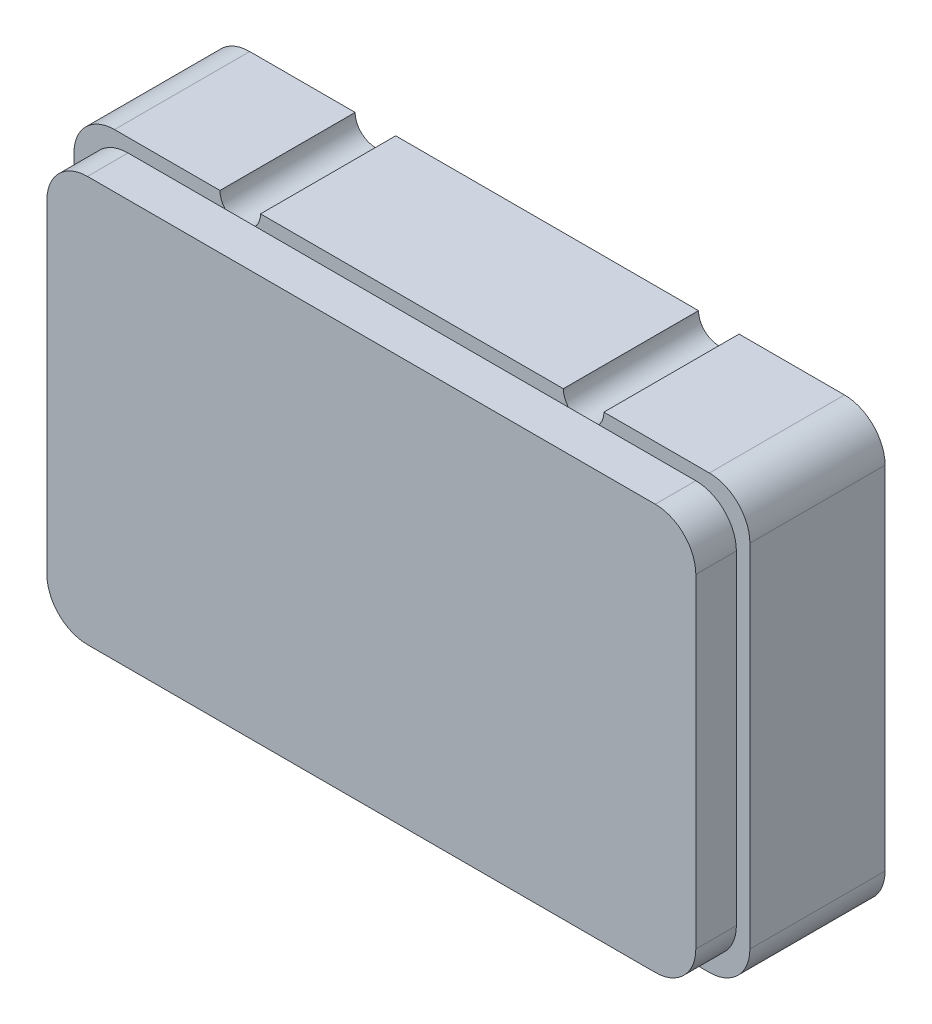
ISO-10303-21;
HEADER;
FILE_DESCRIPTION(('STEP AP214'),'2;1');
FILE_NAME('part.step','',(''),(''),'','','');
FILE_SCHEMA(('AUTOMOTIVE_DESIGN { 1 0 10303 214 1 1 1 1 }'));
ENDSEC;
DATA;
#1=APPLICATION_CONTEXT('core data for automotive mechanical design processes');
#2=APPLICATION_PROTOCOL_DEFINITION('international standard','automotive_design',2000,#1);
#3=PRODUCT_CONTEXT('',#1,'mechanical');
#4=PRODUCT('Part','Part','',(#3));
#5=PRODUCT_RELATED_PRODUCT_CATEGORY('part','',(#4));
#6=PRODUCT_DEFINITION_FORMATION('','',#4);
#7=PRODUCT_DEFINITION_CONTEXT('part definition',#1,'design');
#8=PRODUCT_DEFINITION('design','',#6,#7);
#9=PRODUCT_DEFINITION_SHAPE('','',#8);
#10=(LENGTH_UNIT() NAMED_UNIT(*) SI_UNIT(.MILLI.,.METRE.));
#11=(NAMED_UNIT(*) PLANE_ANGLE_UNIT() SI_UNIT($,.RADIAN.));
#12=(NAMED_UNIT(*) SI_UNIT($,.STERADIAN.) SOLID_ANGLE_UNIT());
#13=UNCERTAINTY_MEASURE_WITH_UNIT(LENGTH_MEASURE(1.E-05),#10,'distance_accuracy_value','');
#14=(GEOMETRIC_REPRESENTATION_CONTEXT(3) GLOBAL_UNCERTAINTY_ASSIGNED_CONTEXT((#13)) GLOBAL_UNIT_ASSIGNED_CONTEXT((#10,
#11,#12)) REPRESENTATION_CONTEXT('',''));
#15=CARTESIAN_POINT('',(0.,0.,0.));
#16=DIRECTION('',(0.,0.,1.));
#17=DIRECTION('',(1.,0.,0.));
#18=AXIS2_PLACEMENT_3D('',#15,#16,#17);
#19=CARTESIAN_POINT('',(0.,0.,1.));
#20=DIRECTION('',(0.,0.,-1.));
#21=DIRECTION('',(-1.,0.,0.));
#22=AXIS2_PLACEMENT_3D('',#19,#20,#21);
#23=PLANE('',#22);
#24=CARTESIAN_POINT('',(1.23,0.,1.));
#25=DIRECTION('',(0.,0.,-1.));
#26=DIRECTION('',(-1.,0.,0.));
#27=AXIS2_PLACEMENT_3D('',#24,#25,#26);
#28=CIRCLE('',#27,0.15);
#29=CARTESIAN_POINT('',(1.34180339887499,0.1,1.));
#30=VERTEX_POINT('',#29);
#31=CARTESIAN_POINT('',(1.38,0.,1.));
#32=VERTEX_POINT('',#31);
#33=EDGE_CURVE('E444',#30,#32,#28,.T.);
#34=ORIENTED_EDGE('',*,*,#33,.T.);
#35=DIRECTION('',(1.,0.,0.));
#36=VECTOR('',#35,1.);
#37=CARTESIAN_POINT('',(0.,0.,1.));
#38=LINE('',#37,#36);
#39=CARTESIAN_POINT('',(3.62,0.,1.));
#40=VERTEX_POINT('',#39);
#41=EDGE_CURVE('E236',#32,#40,#38,.T.);
#42=ORIENTED_EDGE('',*,*,#41,.T.);
#43=CARTESIAN_POINT('',(3.77,0.,1.));
#44=DIRECTION('',(0.,0.,-1.));
#45=DIRECTION('',(-1.,0.,0.));
#46=AXIS2_PLACEMENT_3D('',#43,#44,#45);
#47=CIRCLE('',#46,0.15);
#48=CARTESIAN_POINT('',(3.65819660112501,0.1,1.));
#49=VERTEX_POINT('',#48);
#50=EDGE_CURVE('E509',#40,#49,#47,.T.);
#51=ORIENTED_EDGE('',*,*,#50,.T.);
#52=DIRECTION('',(1.,0.,0.));
#53=VECTOR('',#52,1.);
#54=CARTESIAN_POINT('',(0.1,0.1,1.));
#55=LINE('',#54,#53);
#56=EDGE_CURVE('E398',#30,#49,#55,.T.);
#57=ORIENTED_EDGE('',*,*,#56,.F.);
#58=EDGE_LOOP('',(#34,#42,#51,#57));
#59=FACE_BOUND('',#58,.T.);
#60=ADVANCED_FACE('F33',(#59),#23,.F.);
#61=CARTESIAN_POINT('',(1.08,0.,1.));
#62=VERTEX_POINT('',#61);
#63=CARTESIAN_POINT('',(1.11819660112501,0.1,1.));
#64=VERTEX_POINT('',#63);
#65=EDGE_CURVE('E442',#62,#64,#28,.T.);
#66=ORIENTED_EDGE('',*,*,#65,.T.);
#67=CARTESIAN_POINT('',(0.4,0.1,1.));
#68=VERTEX_POINT('',#67);
#69=EDGE_CURVE('E393',#68,#64,#55,.T.);
#70=ORIENTED_EDGE('',*,*,#69,.F.);
#71=CARTESIAN_POINT('',(0.4,0.4,1.));
#72=DIRECTION('',(0.,0.,-1.));
#73=DIRECTION('',(-1.,0.,0.));
#74=AXIS2_PLACEMENT_3D('',#71,#72,#73);
#75=CIRCLE('',#74,0.3);
#76=CARTESIAN_POINT('',(0.1,0.4,1.));
#77=VERTEX_POINT('',#76);
#78=EDGE_CURVE('E292',#68,#77,#75,.T.);
#79=ORIENTED_EDGE('',*,*,#78,.T.);
#80=DIRECTION('',(0.,-1.,0.));
#81=VECTOR('',#80,1.);
#82=CARTESIAN_POINT('',(0.1,0.1,1.));
#83=LINE('',#82,#81);
#84=CARTESIAN_POINT('',(0.1,2.8,1.));
#85=VERTEX_POINT('',#84);
#86=EDGE_CURVE('E389',#85,#77,#83,.T.);
#87=ORIENTED_EDGE('',*,*,#86,.F.);
#88=CARTESIAN_POINT('',(0.4,2.8,1.));
#89=DIRECTION('',(0.,0.,-1.));
#90=DIRECTION('',(-1.,0.,0.));
#91=AXIS2_PLACEMENT_3D('',#88,#89,#90);
#92=CIRCLE('',#91,0.3);
#93=CARTESIAN_POINT('',(0.4,3.1,1.));
#94=VERTEX_POINT('',#93);
#95=EDGE_CURVE('E289',#85,#94,#92,.T.);
#96=ORIENTED_EDGE('',*,*,#95,.T.);
#97=DIRECTION('',(-1.,0.,0.));
#98=VECTOR('',#97,1.);
#99=CARTESIAN_POINT('',(0.1,3.1,1.));
#100=LINE('',#99,#98);
#101=CARTESIAN_POINT('',(1.11819660112501,3.1,1.));
#102=VERTEX_POINT('',#101);
#103=EDGE_CURVE('E402',#102,#94,#100,.T.);
#104=ORIENTED_EDGE('',*,*,#103,.F.);
#105=CARTESIAN_POINT('',(1.23,3.2,1.));
#106=DIRECTION('',(0.,0.,-1.));
#107=DIRECTION('',(-1.,0.,0.));
#108=AXIS2_PLACEMENT_3D('',#105,#106,#107);
#109=CIRCLE('',#108,0.15);
#110=CARTESIAN_POINT('',(1.08,3.2,1.));
#111=VERTEX_POINT('',#110);
#112=EDGE_CURVE('E363',#111,#102,#109,.F.);
#113=ORIENTED_EDGE('',*,*,#112,.F.);
#114=DIRECTION('',(-1.,0.,0.));
#115=VECTOR('',#114,1.);
#116=CARTESIAN_POINT('',(0.,3.2,1.));
#117=LINE('',#116,#115);
#118=CARTESIAN_POINT('',(0.299999999999998,3.2,1.));
#119=VERTEX_POINT('',#118);
#120=EDGE_CURVE('E347',#111,#119,#117,.T.);
#121=ORIENTED_EDGE('',*,*,#120,.T.);
#122=CARTESIAN_POINT('',(0.299999999999998,2.9,1.));
#123=DIRECTION('',(0.,0.,-1.));
#124=DIRECTION('',(-1.,0.,0.));
#125=AXIS2_PLACEMENT_3D('',#122,#123,#124);
#126=CIRCLE('',#125,0.299999999999998);
#127=CARTESIAN_POINT('',(0.,2.9,1.));
#128=VERTEX_POINT('',#127);
#129=EDGE_CURVE('E324',#119,#128,#126,.F.);
#130=ORIENTED_EDGE('',*,*,#129,.T.);
#131=DIRECTION('',(0.,-1.,0.));
#132=VECTOR('',#131,1.);
#133=CARTESIAN_POINT('',(0.,0.,1.));
#134=LINE('',#133,#132);
#135=CARTESIAN_POINT('',(0.,0.299999999999998,1.));
#136=VERTEX_POINT('',#135);
#137=EDGE_CURVE('E256',#128,#136,#134,.T.);
#138=ORIENTED_EDGE('',*,*,#137,.T.);
#139=CARTESIAN_POINT('',(0.299999999999998,0.299999999999998,1.));
#140=DIRECTION('',(0.,0.,-1.));
#141=DIRECTION('',(-1.,0.,0.));
#142=AXIS2_PLACEMENT_3D('',#139,#140,#141);
#143=CIRCLE('',#142,0.299999999999998);
#144=CARTESIAN_POINT('',(0.299999999999998,0.,1.));
#145=VERTEX_POINT('',#144);
#146=EDGE_CURVE('E322',#136,#145,#143,.F.);
#147=ORIENTED_EDGE('',*,*,#146,.T.);
#148=EDGE_CURVE('E348',#145,#62,#38,.T.);
#149=ORIENTED_EDGE('',*,*,#148,.T.);
#150=EDGE_LOOP('',(#66,#70,#79,#87,#96,#104,#113,#121,#130,#138,#147,#149));
#151=FACE_BOUND('',#150,.T.);
#152=ADVANCED_FACE('F417',(#151),#23,.F.);
#153=CARTESIAN_POINT('',(0.,0.,1.));
#154=DIRECTION('',(0.,1.,0.));
#155=DIRECTION('',(0.,0.,1.));
#156=AXIS2_PLACEMENT_3D('',#153,#154,#155);
#157=PLANE('',#156);
#158=DIRECTION('',(0.,0.,-1.));
#159=VECTOR('',#158,1.);
#160=CARTESIAN_POINT('',(1.38,0.,1.33541019662497));
#161=LINE('',#160,#159);
#162=CARTESIAN_POINT('',(1.38,0.,0.));
#163=VERTEX_POINT('',#162);
#164=EDGE_CURVE('E221',#32,#163,#161,.T.);
#165=ORIENTED_EDGE('',*,*,#164,.T.);
#166=DIRECTION('',(1.,0.,0.));
#167=VECTOR('',#166,1.);
#168=CARTESIAN_POINT('',(0.,0.,0.));
#169=LINE('',#168,#167);
#170=CARTESIAN_POINT('',(3.62,0.,0.));
#171=VERTEX_POINT('',#170);
#172=EDGE_CURVE('E234',#163,#171,#169,.T.);
#173=ORIENTED_EDGE('',*,*,#172,.T.);
#174=DIRECTION('',(0.,0.,-1.));
#175=VECTOR('',#174,1.);
#176=CARTESIAN_POINT('',(3.62,0.,1.33541019662497));
#177=LINE('',#176,#175);
#178=EDGE_CURVE('E516',#40,#171,#177,.T.);
#179=ORIENTED_EDGE('',*,*,#178,.F.);
#180=ORIENTED_EDGE('',*,*,#41,.F.);
#181=EDGE_LOOP('',(#165,#173,#179,#180));
#182=FACE_BOUND('',#181,.T.);
#183=ADVANCED_FACE('F232',(#182),#157,.F.);
#184=DIRECTION('',(0.,0.,-1.));
#185=VECTOR('',#184,1.);
#186=CARTESIAN_POINT('',(1.08,0.,1.33541019662497));
#187=LINE('',#186,#185);
#188=CARTESIAN_POINT('',(1.08,0.,0.));
#189=VERTEX_POINT('',#188);
#190=EDGE_CURVE('E224',#62,#189,#187,.T.);
#191=ORIENTED_EDGE('',*,*,#190,.F.);
#192=ORIENTED_EDGE('',*,*,#148,.F.);
#193=DIRECTION('',(0.,0.,-1.));
#194=VECTOR('',#193,1.);
#195=CARTESIAN_POINT('',(0.299999999999998,0.,1.));
#196=LINE('',#195,#194);
#197=CARTESIAN_POINT('',(0.299999999999998,0.,0.));
#198=VERTEX_POINT('',#197);
#199=EDGE_CURVE('E329',#145,#198,#196,.T.);
#200=ORIENTED_EDGE('',*,*,#199,.T.);
#201=EDGE_CURVE('E242',#198,#189,#169,.T.);
#202=ORIENTED_EDGE('',*,*,#201,.T.);
#203=EDGE_LOOP('',(#191,#192,#200,#202));
#204=FACE_BOUND('',#203,.T.);
#205=ADVANCED_FACE('F440',(#204),#157,.F.);
#206=CARTESIAN_POINT('',(0.,0.,0.));
#207=DIRECTION('',(0.,0.,-1.));
#208=DIRECTION('',(-1.,0.,0.));
#209=AXIS2_PLACEMENT_3D('',#206,#207,#208);
#210=PLANE('',#209);
#211=ORIENTED_EDGE('',*,*,#172,.F.);
#212=CARTESIAN_POINT('',(1.23,0.,0.));
#213=DIRECTION('',(0.,0.,1.));
#214=DIRECTION('',(-1.,0.,0.));
#215=AXIS2_PLACEMENT_3D('',#212,#213,#214);
#216=CIRCLE('',#215,0.15);
#217=EDGE_CURVE('E218',#163,#189,#216,.T.);
#218=ORIENTED_EDGE('',*,*,#217,.T.);
#219=ORIENTED_EDGE('',*,*,#201,.F.);
#220=CARTESIAN_POINT('',(0.299999999999998,0.299999999999998,0.));
#221=DIRECTION('',(0.,0.,-1.));
#222=DIRECTION('',(-1.,0.,0.));
#223=AXIS2_PLACEMENT_3D('',#220,#221,#222);
#224=CIRCLE('',#223,0.299999999999998);
#225=CARTESIAN_POINT('',(0.,0.299999999999998,0.));
#226=VERTEX_POINT('',#225);
#227=EDGE_CURVE('E307',#198,#226,#224,.T.);
#228=ORIENTED_EDGE('',*,*,#227,.T.);
#229=DIRECTION('',(0.,-1.,0.));
#230=VECTOR('',#229,1.);
#231=CARTESIAN_POINT('',(0.,0.,0.));
#232=LINE('',#231,#230);
#233=CARTESIAN_POINT('',(0.,2.9,0.));
#234=VERTEX_POINT('',#233);
#235=EDGE_CURVE('E246',#234,#226,#232,.T.);
#236=ORIENTED_EDGE('',*,*,#235,.F.);
#237=CARTESIAN_POINT('',(0.299999999999998,2.9,0.));
#238=DIRECTION('',(0.,0.,-1.));
#239=DIRECTION('',(-1.,0.,0.));
#240=AXIS2_PLACEMENT_3D('',#237,#238,#239);
#241=CIRCLE('',#240,0.299999999999998);
#242=CARTESIAN_POINT('',(0.299999999999998,3.2,0.));
#243=VERTEX_POINT('',#242);
#244=EDGE_CURVE('E309',#234,#243,#241,.T.);
#245=ORIENTED_EDGE('',*,*,#244,.T.);
#246=DIRECTION('',(-1.,0.,0.));
#247=VECTOR('',#246,1.);
#248=CARTESIAN_POINT('',(0.,3.2,0.));
#249=LINE('',#248,#247);
#250=CARTESIAN_POINT('',(1.08,3.2,0.));
#251=VERTEX_POINT('',#250);
#252=EDGE_CURVE('E252',#251,#243,#249,.T.);
#253=ORIENTED_EDGE('',*,*,#252,.F.);
#254=CARTESIAN_POINT('',(1.23,3.2,0.));
#255=DIRECTION('',(0.,0.,-1.));
#256=DIRECTION('',(-1.,0.,0.));
#257=AXIS2_PLACEMENT_3D('',#254,#255,#256);
#258=CIRCLE('',#257,0.15);
#259=CARTESIAN_POINT('',(1.38,3.2,0.));
#260=VERTEX_POINT('',#259);
#261=EDGE_CURVE('E512',#260,#251,#258,.T.);
#262=ORIENTED_EDGE('',*,*,#261,.F.);
#263=CARTESIAN_POINT('',(3.62,3.2,0.));
#264=VERTEX_POINT('',#263);
#265=EDGE_CURVE('E257',#264,#260,#249,.T.);
#266=ORIENTED_EDGE('',*,*,#265,.F.);
#267=CARTESIAN_POINT('',(3.77,3.2,0.));
#268=DIRECTION('',(0.,0.,-1.));
#269=DIRECTION('',(-1.,0.,0.));
#270=AXIS2_PLACEMENT_3D('',#267,#268,#269);
#271=CIRCLE('',#270,0.15);
#272=CARTESIAN_POINT('',(3.92,3.2,0.));
#273=VERTEX_POINT('',#272);
#274=EDGE_CURVE('E357',#273,#264,#271,.T.);
#275=ORIENTED_EDGE('',*,*,#274,.F.);
#276=CARTESIAN_POINT('',(4.7,3.2,0.));
#277=VERTEX_POINT('',#276);
#278=EDGE_CURVE('E253',#277,#273,#249,.T.);
#279=ORIENTED_EDGE('',*,*,#278,.F.);
#280=CARTESIAN_POINT('',(4.7,2.9,0.));
#281=DIRECTION('',(0.,0.,-1.));
#282=DIRECTION('',(-1.,0.,0.));
#283=AXIS2_PLACEMENT_3D('',#280,#281,#282);
#284=CIRCLE('',#283,0.299999999999998);
#285=CARTESIAN_POINT('',(5.,2.9,0.));
#286=VERTEX_POINT('',#285);
#287=EDGE_CURVE('E302',#277,#286,#284,.T.);
#288=ORIENTED_EDGE('',*,*,#287,.T.);
#289=DIRECTION('',(0.,1.,0.));
#290=VECTOR('',#289,1.);
#291=CARTESIAN_POINT('',(5.,0.,0.));
#292=LINE('',#291,#290);
#293=CARTESIAN_POINT('',(5.,0.299999999999998,0.));
#294=VERTEX_POINT('',#293);
#295=EDGE_CURVE('E245',#294,#286,#292,.T.);
#296=ORIENTED_EDGE('',*,*,#295,.F.);
#297=CARTESIAN_POINT('',(4.7,0.299999999999998,0.));
#298=DIRECTION('',(0.,0.,-1.));
#299=DIRECTION('',(-1.,0.,0.));
#300=AXIS2_PLACEMENT_3D('',#297,#298,#299);
#301=CIRCLE('',#300,0.299999999999998);
#302=CARTESIAN_POINT('',(4.7,0.,0.));
#303=VERTEX_POINT('',#302);
#304=EDGE_CURVE('E304',#294,#303,#301,.T.);
#305=ORIENTED_EDGE('',*,*,#304,.T.);
#306=CARTESIAN_POINT('',(3.92,0.,0.));
#307=VERTEX_POINT('',#306);
#308=EDGE_CURVE('E243',#307,#303,#169,.T.);
#309=ORIENTED_EDGE('',*,*,#308,.F.);
#310=CARTESIAN_POINT('',(3.77,0.,0.));
#311=DIRECTION('',(0.,0.,1.));
#312=DIRECTION('',(-1.,0.,0.));
#313=AXIS2_PLACEMENT_3D('',#310,#311,#312);
#314=CIRCLE('',#313,0.15);
#315=EDGE_CURVE('E241',#307,#171,#314,.T.);
#316=ORIENTED_EDGE('',*,*,#315,.T.);
#317=EDGE_LOOP('',(#211,#218,#219,#228,#236,#245,#253,#262,#266,#275,#279,#288,#296,#305,#309,#316));
#318=FACE_BOUND('',#317,.T.);
#319=ADVANCED_FACE('F239',(#318),#210,.T.);
#320=CARTESIAN_POINT('',(3.88180339887499,0.1,1.));
#321=VERTEX_POINT('',#320);
#322=CARTESIAN_POINT('',(3.92,0.,1.));
#323=VERTEX_POINT('',#322);
#324=EDGE_CURVE('E501',#321,#323,#47,.T.);
#325=ORIENTED_EDGE('',*,*,#324,.T.);
#326=CARTESIAN_POINT('',(4.7,0.,1.));
#327=VERTEX_POINT('',#326);
#328=EDGE_CURVE('E408',#323,#327,#38,.T.);
#329=ORIENTED_EDGE('',*,*,#328,.T.);
#330=CARTESIAN_POINT('',(4.7,0.299999999999998,1.));
#331=DIRECTION('',(0.,0.,-1.));
#332=DIRECTION('',(-1.,0.,0.));
#333=AXIS2_PLACEMENT_3D('',#330,#331,#332);
#334=CIRCLE('',#333,0.299999999999998);
#335=CARTESIAN_POINT('',(5.,0.299999999999998,1.));
#336=VERTEX_POINT('',#335);
#337=EDGE_CURVE('E320',#327,#336,#334,.F.);
#338=ORIENTED_EDGE('',*,*,#337,.T.);
#339=DIRECTION('',(0.,1.,0.));
#340=VECTOR('',#339,1.);
#341=CARTESIAN_POINT('',(5.,0.,1.));
#342=LINE('',#341,#340);
#343=CARTESIAN_POINT('',(5.,2.9,1.));
#344=VERTEX_POINT('',#343);
#345=EDGE_CURVE('E336',#336,#344,#342,.T.);
#346=ORIENTED_EDGE('',*,*,#345,.T.);
#347=CARTESIAN_POINT('',(4.7,2.9,1.));
#348=DIRECTION('',(0.,0.,-1.));
#349=DIRECTION('',(-1.,0.,0.));
#350=AXIS2_PLACEMENT_3D('',#347,#348,#349);
#351=CIRCLE('',#350,0.299999999999998);
#352=CARTESIAN_POINT('',(4.7,3.2,1.));
#353=VERTEX_POINT('',#352);
#354=EDGE_CURVE('E318',#344,#353,#351,.F.);
#355=ORIENTED_EDGE('',*,*,#354,.T.);
#356=CARTESIAN_POINT('',(3.92,3.2,1.));
#357=VERTEX_POINT('',#356);
#358=EDGE_CURVE('E261',#353,#357,#117,.T.);
#359=ORIENTED_EDGE('',*,*,#358,.T.);
#360=CARTESIAN_POINT('',(3.77,3.2,1.));
#361=DIRECTION('',(0.,0.,-1.));
#362=DIRECTION('',(-1.,0.,0.));
#363=AXIS2_PLACEMENT_3D('',#360,#361,#362);
#364=CIRCLE('',#363,0.15);
#365=CARTESIAN_POINT('',(3.88180339887499,3.1,1.));
#366=VERTEX_POINT('',#365);
#367=EDGE_CURVE('E374',#366,#357,#364,.F.);
#368=ORIENTED_EDGE('',*,*,#367,.F.);
#369=CARTESIAN_POINT('',(4.6,3.1,1.));
#370=VERTEX_POINT('',#369);
#371=EDGE_CURVE('E380',#370,#366,#100,.T.);
#372=ORIENTED_EDGE('',*,*,#371,.F.);
#373=CARTESIAN_POINT('',(4.6,2.8,1.));
#374=DIRECTION('',(0.,0.,-1.));
#375=DIRECTION('',(-1.,0.,0.));
#376=AXIS2_PLACEMENT_3D('',#373,#374,#375);
#377=CIRCLE('',#376,0.3);
#378=CARTESIAN_POINT('',(4.9,2.8,1.));
#379=VERTEX_POINT('',#378);
#380=EDGE_CURVE('E287',#370,#379,#377,.T.);
#381=ORIENTED_EDGE('',*,*,#380,.T.);
#382=DIRECTION('',(0.,1.,0.));
#383=VECTOR('',#382,1.);
#384=CARTESIAN_POINT('',(4.9,0.100000000000001,1.));
#385=LINE('',#384,#383);
#386=CARTESIAN_POINT('',(4.9,0.400000000000001,1.));
#387=VERTEX_POINT('',#386);
#388=EDGE_CURVE('E396',#387,#379,#385,.T.);
#389=ORIENTED_EDGE('',*,*,#388,.F.);
#390=CARTESIAN_POINT('',(4.6,0.400000000000001,1.));
#391=DIRECTION('',(0.,0.,-1.));
#392=DIRECTION('',(-1.,0.,0.));
#393=AXIS2_PLACEMENT_3D('',#390,#391,#392);
#394=CIRCLE('',#393,0.3);
#395=CARTESIAN_POINT('',(4.6,0.100000000000001,1.));
#396=VERTEX_POINT('',#395);
#397=EDGE_CURVE('E294',#387,#396,#394,.T.);
#398=ORIENTED_EDGE('',*,*,#397,.T.);
#399=EDGE_CURVE('E392',#321,#396,#55,.T.);
#400=ORIENTED_EDGE('',*,*,#399,.F.);
#401=EDGE_LOOP('',(#325,#329,#338,#346,#355,#359,#368,#372,#381,#389,#398,#400));
#402=FACE_BOUND('',#401,.T.);
#403=ADVANCED_FACE('F343',(#402),#23,.F.);
#404=DIRECTION('',(0.,0.,-1.));
#405=VECTOR('',#404,1.);
#406=CARTESIAN_POINT('',(3.92,0.,1.33541019662497));
#407=LINE('',#406,#405);
#408=EDGE_CURVE('E517',#323,#307,#407,.T.);
#409=ORIENTED_EDGE('',*,*,#408,.T.);
#410=ORIENTED_EDGE('',*,*,#308,.T.);
#411=DIRECTION('',(0.,0.,-1.));
#412=VECTOR('',#411,1.);
#413=CARTESIAN_POINT('',(4.7,0.,1.));
#414=LINE('',#413,#412);
#415=EDGE_CURVE('E326',#303,#327,#414,.F.);
#416=ORIENTED_EDGE('',*,*,#415,.T.);
#417=ORIENTED_EDGE('',*,*,#328,.F.);
#418=EDGE_LOOP('',(#409,#410,#416,#417));
#419=FACE_BOUND('',#418,.T.);
#420=ADVANCED_FACE('F550',(#419),#157,.F.);
#421=CARTESIAN_POINT('',(0.,3.2,1.));
#422=DIRECTION('',(0.,-1.,0.));
#423=DIRECTION('',(0.,0.,-1.));
#424=AXIS2_PLACEMENT_3D('',#421,#422,#423);
#425=PLANE('',#424);
#426=ORIENTED_EDGE('',*,*,#120,.F.);
#427=DIRECTION('',(0.,0.,-1.));
#428=VECTOR('',#427,1.);
#429=CARTESIAN_POINT('',(1.08,3.2,1.33541019662497));
#430=LINE('',#429,#428);
#431=EDGE_CURVE('E513',#111,#251,#430,.T.);
#432=ORIENTED_EDGE('',*,*,#431,.T.);
#433=ORIENTED_EDGE('',*,*,#252,.T.);
#434=DIRECTION('',(0.,0.,-1.));
#435=VECTOR('',#434,1.);
#436=CARTESIAN_POINT('',(0.299999999999998,3.2,1.));
#437=LINE('',#436,#435);
#438=EDGE_CURVE('E315',#243,#119,#437,.F.);
#439=ORIENTED_EDGE('',*,*,#438,.T.);
#440=EDGE_LOOP('',(#426,#432,#433,#439));
#441=FACE_BOUND('',#440,.T.);
#442=ADVANCED_FACE('F424',(#441),#425,.F.);
#443=CARTESIAN_POINT('',(3.62,3.2,1.));
#444=VERTEX_POINT('',#443);
#445=CARTESIAN_POINT('',(1.38,3.2,1.));
#446=VERTEX_POINT('',#445);
#447=EDGE_CURVE('E410',#444,#446,#117,.T.);
#448=ORIENTED_EDGE('',*,*,#447,.T.);
#449=CARTESIAN_POINT('',(1.34180339887499,3.1,1.));
#450=VERTEX_POINT('',#449);
#451=EDGE_CURVE('E369',#450,#446,#109,.F.);
#452=ORIENTED_EDGE('',*,*,#451,.F.);
#453=CARTESIAN_POINT('',(3.65819660112501,3.1,1.));
#454=VERTEX_POINT('',#453);
#455=EDGE_CURVE('E471',#454,#450,#100,.T.);
#456=ORIENTED_EDGE('',*,*,#455,.F.);
#457=EDGE_CURVE('E372',#444,#454,#364,.F.);
#458=ORIENTED_EDGE('',*,*,#457,.F.);
#459=EDGE_LOOP('',(#448,#452,#456,#458));
#460=FACE_BOUND('',#459,.T.);
#461=ADVANCED_FACE('F529',(#460),#23,.F.);
#462=ORIENTED_EDGE('',*,*,#265,.T.);
#463=DIRECTION('',(0.,0.,-1.));
#464=VECTOR('',#463,1.);
#465=CARTESIAN_POINT('',(1.38,3.2,1.33541019662497));
#466=LINE('',#465,#464);
#467=EDGE_CURVE('E522',#446,#260,#466,.T.);
#468=ORIENTED_EDGE('',*,*,#467,.F.);
#469=ORIENTED_EDGE('',*,*,#447,.F.);
#470=DIRECTION('',(0.,0.,-1.));
#471=VECTOR('',#470,1.);
#472=CARTESIAN_POINT('',(3.62,3.2,1.33541019662497));
#473=LINE('',#472,#471);
#474=EDGE_CURVE('E362',#444,#264,#473,.T.);
#475=ORIENTED_EDGE('',*,*,#474,.T.);
#476=EDGE_LOOP('',(#462,#468,#469,#475));
#477=FACE_BOUND('',#476,.T.);
#478=ADVANCED_FACE('F526',(#477),#425,.F.);
#479=CARTESIAN_POINT('',(0.,0.,1.));
#480=DIRECTION('',(1.,0.,0.));
#481=DIRECTION('',(0.,0.,-1.));
#482=AXIS2_PLACEMENT_3D('',#479,#480,#481);
#483=PLANE('',#482);
#484=ORIENTED_EDGE('',*,*,#137,.F.);
#485=DIRECTION('',(0.,0.,-1.));
#486=VECTOR('',#485,1.);
#487=CARTESIAN_POINT('',(0.,2.9,1.));
#488=LINE('',#487,#486);
#489=EDGE_CURVE('E299',#128,#234,#488,.T.);
#490=ORIENTED_EDGE('',*,*,#489,.T.);
#491=ORIENTED_EDGE('',*,*,#235,.T.);
#492=DIRECTION('',(0.,0.,-1.));
#493=VECTOR('',#492,1.);
#494=CARTESIAN_POINT('',(0.,0.299999999999998,1.));
#495=LINE('',#494,#493);
#496=EDGE_CURVE('E297',#226,#136,#495,.F.);
#497=ORIENTED_EDGE('',*,*,#496,.T.);
#498=EDGE_LOOP('',(#484,#490,#491,#497));
#499=FACE_BOUND('',#498,.T.);
#500=ADVANCED_FACE('F432',(#499),#483,.F.);
#501=CARTESIAN_POINT('',(5.,0.,1.));
#502=DIRECTION('',(-1.,0.,0.));
#503=DIRECTION('',(0.,0.,1.));
#504=AXIS2_PLACEMENT_3D('',#501,#502,#503);
#505=PLANE('',#504);
#506=ORIENTED_EDGE('',*,*,#345,.F.);
#507=DIRECTION('',(0.,0.,-1.));
#508=VECTOR('',#507,1.);
#509=CARTESIAN_POINT('',(5.,0.299999999999998,1.));
#510=LINE('',#509,#508);
#511=EDGE_CURVE('E11',#336,#294,#510,.T.);
#512=ORIENTED_EDGE('',*,*,#511,.T.);
#513=ORIENTED_EDGE('',*,*,#295,.T.);
#514=DIRECTION('',(0.,0.,-1.));
#515=VECTOR('',#514,1.);
#516=CARTESIAN_POINT('',(5.,2.9,1.));
#517=LINE('',#516,#515);
#518=EDGE_CURVE('E41',#286,#344,#517,.F.);
#519=ORIENTED_EDGE('',*,*,#518,.T.);
#520=EDGE_LOOP('',(#506,#512,#513,#519));
#521=FACE_BOUND('',#520,.T.);
#522=ADVANCED_FACE('F335',(#521),#505,.F.);
#523=ORIENTED_EDGE('',*,*,#278,.T.);
#524=DIRECTION('',(0.,0.,-1.));
#525=VECTOR('',#524,1.);
#526=CARTESIAN_POINT('',(3.92,3.2,1.33541019662497));
#527=LINE('',#526,#525);
#528=EDGE_CURVE('E365',#357,#273,#527,.T.);
#529=ORIENTED_EDGE('',*,*,#528,.F.);
#530=ORIENTED_EDGE('',*,*,#358,.F.);
#531=DIRECTION('',(0.,0.,-1.));
#532=VECTOR('',#531,1.);
#533=CARTESIAN_POINT('',(4.7,3.2,1.));
#534=LINE('',#533,#532);
#535=EDGE_CURVE('E312',#353,#277,#534,.T.);
#536=ORIENTED_EDGE('',*,*,#535,.T.);
#537=EDGE_LOOP('',(#523,#529,#530,#536));
#538=FACE_BOUND('',#537,.T.);
#539=ADVANCED_FACE('F353',(#538),#425,.F.);
#540=CARTESIAN_POINT('',(0.1,0.1,1.3));
#541=DIRECTION('',(1.,0.,0.));
#542=DIRECTION('',(0.,0.,-1.));
#543=AXIS2_PLACEMENT_3D('',#540,#541,#542);
#544=PLANE('',#543);
#545=DIRECTION('',(0.,-1.,0.));
#546=VECTOR('',#545,1.);
#547=CARTESIAN_POINT('',(0.1,0.1,1.3));
#548=LINE('',#547,#546);
#549=CARTESIAN_POINT('',(0.1,2.8,1.3));
#550=VERTEX_POINT('',#549);
#551=CARTESIAN_POINT('',(0.1,0.4,1.3));
#552=VERTEX_POINT('',#551);
#553=EDGE_CURVE('E376',#550,#552,#548,.T.);
#554=ORIENTED_EDGE('',*,*,#553,.F.);
#555=DIRECTION('',(0.,0.,-1.));
#556=VECTOR('',#555,1.);
#557=CARTESIAN_POINT('',(0.1,2.8,1.3));
#558=LINE('',#557,#556);
#559=EDGE_CURVE('E279',#550,#85,#558,.T.);
#560=ORIENTED_EDGE('',*,*,#559,.T.);
#561=ORIENTED_EDGE('',*,*,#86,.T.);
#562=DIRECTION('',(0.,0.,-1.));
#563=VECTOR('',#562,1.);
#564=CARTESIAN_POINT('',(0.1,0.4,1.3));
#565=LINE('',#564,#563);
#566=EDGE_CURVE('E277',#77,#552,#565,.F.);
#567=ORIENTED_EDGE('',*,*,#566,.T.);
#568=EDGE_LOOP('',(#554,#560,#561,#567));
#569=FACE_BOUND('',#568,.T.);
#570=ADVANCED_FACE('F457',(#569),#544,.F.);
#571=CARTESIAN_POINT('',(0.1,0.1,1.3));
#572=DIRECTION('',(0.,1.,0.));
#573=DIRECTION('',(-1.,0.,0.));
#574=AXIS2_PLACEMENT_3D('',#571,#572,#573);
#575=PLANE('',#574);
#576=DIRECTION('',(1.,0.,0.));
#577=VECTOR('',#576,1.);
#578=CARTESIAN_POINT('',(0.1,0.1,1.3));
#579=LINE('',#578,#577);
#580=CARTESIAN_POINT('',(0.4,0.1,1.3));
#581=VERTEX_POINT('',#580);
#582=CARTESIAN_POINT('',(4.6,0.100000000000001,1.3));
#583=VERTEX_POINT('',#582);
#584=EDGE_CURVE('E379',#581,#583,#579,.T.);
#585=ORIENTED_EDGE('',*,*,#584,.F.);
#586=DIRECTION('',(0.,0.,-1.));
#587=VECTOR('',#586,1.);
#588=CARTESIAN_POINT('',(0.4,0.1,1.3));
#589=LINE('',#588,#587);
#590=EDGE_CURVE('E284',#581,#68,#589,.T.);
#591=ORIENTED_EDGE('',*,*,#590,.T.);
#592=ORIENTED_EDGE('',*,*,#69,.T.);
#593=EDGE_CURVE('E397',#64,#30,#55,.T.);
#594=ORIENTED_EDGE('',*,*,#593,.T.);
#595=ORIENTED_EDGE('',*,*,#56,.T.);
#596=EDGE_CURVE('E399',#49,#321,#55,.T.);
#597=ORIENTED_EDGE('',*,*,#596,.T.);
#598=ORIENTED_EDGE('',*,*,#399,.T.);
#599=DIRECTION('',(0.,0.,-1.));
#600=VECTOR('',#599,1.);
#601=CARTESIAN_POINT('',(4.6,0.100000000000001,1.3));
#602=LINE('',#601,#600);
#603=EDGE_CURVE('E282',#396,#583,#602,.F.);
#604=ORIENTED_EDGE('',*,*,#603,.T.);
#605=EDGE_LOOP('',(#585,#591,#592,#594,#595,#597,#598,#604));
#606=FACE_BOUND('',#605,.T.);
#607=ADVANCED_FACE('F448',(#606),#575,.F.);
#608=CARTESIAN_POINT('',(4.9,0.100000000000001,1.3));
#609=DIRECTION('',(-1.,0.,0.));
#610=DIRECTION('',(0.,-1.,0.));
#611=AXIS2_PLACEMENT_3D('',#608,#609,#610);
#612=PLANE('',#611);
#613=ORIENTED_EDGE('',*,*,#388,.T.);
#614=DIRECTION('',(0.,0.,-1.));
#615=VECTOR('',#614,1.);
#616=CARTESIAN_POINT('',(4.9,2.8,1.3));
#617=LINE('',#616,#615);
#618=CARTESIAN_POINT('',(4.9,2.8,1.3));
#619=VERTEX_POINT('',#618);
#620=EDGE_CURVE('E267',#379,#619,#617,.F.);
#621=ORIENTED_EDGE('',*,*,#620,.T.);
#622=DIRECTION('',(0.,1.,0.));
#623=VECTOR('',#622,1.);
#624=CARTESIAN_POINT('',(4.9,0.100000000000001,1.3));
#625=LINE('',#624,#623);
#626=CARTESIAN_POINT('',(4.9,0.400000000000001,1.3));
#627=VERTEX_POINT('',#626);
#628=EDGE_CURVE('E383',#627,#619,#625,.T.);
#629=ORIENTED_EDGE('',*,*,#628,.F.);
#630=DIRECTION('',(0.,0.,-1.));
#631=VECTOR('',#630,1.);
#632=CARTESIAN_POINT('',(4.9,0.400000000000001,1.3));
#633=LINE('',#632,#631);
#634=EDGE_CURVE('E264',#627,#387,#633,.T.);
#635=ORIENTED_EDGE('',*,*,#634,.T.);
#636=EDGE_LOOP('',(#613,#621,#629,#635));
#637=FACE_BOUND('',#636,.T.);
#638=ADVANCED_FACE('F488',(#637),#612,.F.);
#639=CARTESIAN_POINT('',(0.1,3.1,1.3));
#640=DIRECTION('',(0.,-1.,0.));
#641=DIRECTION('',(0.,0.,-1.));
#642=AXIS2_PLACEMENT_3D('',#639,#640,#641);
#643=PLANE('',#642);
#644=DIRECTION('',(-1.,0.,0.));
#645=VECTOR('',#644,1.);
#646=CARTESIAN_POINT('',(0.1,3.1,1.3));
#647=LINE('',#646,#645);
#648=CARTESIAN_POINT('',(4.6,3.1,1.3));
#649=VERTEX_POINT('',#648);
#650=CARTESIAN_POINT('',(0.4,3.1,1.3));
#651=VERTEX_POINT('',#650);
#652=EDGE_CURVE('E386',#649,#651,#647,.T.);
#653=ORIENTED_EDGE('',*,*,#652,.F.);
#654=DIRECTION('',(0.,0.,-1.));
#655=VECTOR('',#654,1.);
#656=CARTESIAN_POINT('',(4.6,3.1,1.3));
#657=LINE('',#656,#655);
#658=EDGE_CURVE('E260',#649,#370,#657,.T.);
#659=ORIENTED_EDGE('',*,*,#658,.T.);
#660=ORIENTED_EDGE('',*,*,#371,.T.);
#661=EDGE_CURVE('E405',#366,#454,#100,.T.);
#662=ORIENTED_EDGE('',*,*,#661,.T.);
#663=ORIENTED_EDGE('',*,*,#455,.T.);
#664=EDGE_CURVE('E465',#450,#102,#100,.T.);
#665=ORIENTED_EDGE('',*,*,#664,.T.);
#666=ORIENTED_EDGE('',*,*,#103,.T.);
#667=DIRECTION('',(0.,0.,-1.));
#668=VECTOR('',#667,1.);
#669=CARTESIAN_POINT('',(0.4,3.1,1.3));
#670=LINE('',#669,#668);
#671=EDGE_CURVE('E258',#94,#651,#670,.F.);
#672=ORIENTED_EDGE('',*,*,#671,.T.);
#673=EDGE_LOOP('',(#653,#659,#660,#662,#663,#665,#666,#672));
#674=FACE_BOUND('',#673,.T.);
#675=ADVANCED_FACE('F468',(#674),#643,.F.);
#676=CARTESIAN_POINT('',(0.,0.,1.3));
#677=DIRECTION('',(0.,0.,-1.));
#678=DIRECTION('',(-1.,0.,0.));
#679=AXIS2_PLACEMENT_3D('',#676,#677,#678);
#680=PLANE('',#679);
#681=ORIENTED_EDGE('',*,*,#628,.T.);
#682=CARTESIAN_POINT('',(4.6,2.8,1.3));
#683=DIRECTION('',(0.,0.,-1.));
#684=DIRECTION('',(-1.,0.,0.));
#685=AXIS2_PLACEMENT_3D('',#682,#683,#684);
#686=CIRCLE('',#685,0.3);
#687=EDGE_CURVE('E275',#619,#649,#686,.F.);
#688=ORIENTED_EDGE('',*,*,#687,.T.);
#689=ORIENTED_EDGE('',*,*,#652,.T.);
#690=CARTESIAN_POINT('',(0.4,2.8,1.3));
#691=DIRECTION('',(0.,0.,-1.));
#692=DIRECTION('',(-1.,0.,0.));
#693=AXIS2_PLACEMENT_3D('',#690,#691,#692);
#694=CIRCLE('',#693,0.3);
#695=EDGE_CURVE('E273',#651,#550,#694,.F.);
#696=ORIENTED_EDGE('',*,*,#695,.T.);
#697=ORIENTED_EDGE('',*,*,#553,.T.);
#698=CARTESIAN_POINT('',(0.4,0.4,1.3));
#699=DIRECTION('',(0.,0.,-1.));
#700=DIRECTION('',(-1.,0.,0.));
#701=AXIS2_PLACEMENT_3D('',#698,#699,#700);
#702=CIRCLE('',#701,0.3);
#703=EDGE_CURVE('E271',#552,#581,#702,.F.);
#704=ORIENTED_EDGE('',*,*,#703,.T.);
#705=ORIENTED_EDGE('',*,*,#584,.T.);
#706=CARTESIAN_POINT('',(4.6,0.400000000000001,1.3));
#707=DIRECTION('',(0.,0.,-1.));
#708=DIRECTION('',(-1.,0.,0.));
#709=AXIS2_PLACEMENT_3D('',#706,#707,#708);
#710=CIRCLE('',#709,0.3);
#711=EDGE_CURVE('E269',#583,#627,#710,.F.);
#712=ORIENTED_EDGE('',*,*,#711,.T.);
#713=EDGE_LOOP('',(#681,#688,#689,#696,#697,#704,#705,#712));
#714=FACE_BOUND('',#713,.T.);
#715=ADVANCED_FACE('F494',(#714),#680,.F.);
#716=CARTESIAN_POINT('',(4.6,2.8,1.3));
#717=DIRECTION('',(0.,0.,-1.));
#718=DIRECTION('',(-1.,0.,0.));
#719=AXIS2_PLACEMENT_3D('',#716,#717,#718);
#720=CYLINDRICAL_SURFACE('',#719,0.3);
#721=ORIENTED_EDGE('',*,*,#687,.F.);
#722=ORIENTED_EDGE('',*,*,#620,.F.);
#723=ORIENTED_EDGE('',*,*,#380,.F.);
#724=ORIENTED_EDGE('',*,*,#658,.F.);
#725=EDGE_LOOP('',(#721,#722,#723,#724));
#726=FACE_BOUND('',#725,.T.);
#727=ADVANCED_FACE('F492',(#726),#720,.T.);
#728=CARTESIAN_POINT('',(0.4,2.8,1.3));
#729=DIRECTION('',(0.,0.,-1.));
#730=DIRECTION('',(-1.,0.,0.));
#731=AXIS2_PLACEMENT_3D('',#728,#729,#730);
#732=CYLINDRICAL_SURFACE('',#731,0.3);
#733=ORIENTED_EDGE('',*,*,#695,.F.);
#734=ORIENTED_EDGE('',*,*,#671,.F.);
#735=ORIENTED_EDGE('',*,*,#95,.F.);
#736=ORIENTED_EDGE('',*,*,#559,.F.);
#737=EDGE_LOOP('',(#733,#734,#735,#736));
#738=FACE_BOUND('',#737,.T.);
#739=ADVANCED_FACE('F461',(#738),#732,.T.);
#740=CARTESIAN_POINT('',(0.4,0.4,1.3));
#741=DIRECTION('',(0.,0.,-1.));
#742=DIRECTION('',(-1.,0.,0.));
#743=AXIS2_PLACEMENT_3D('',#740,#741,#742);
#744=CYLINDRICAL_SURFACE('',#743,0.3);
#745=ORIENTED_EDGE('',*,*,#703,.F.);
#746=ORIENTED_EDGE('',*,*,#566,.F.);
#747=ORIENTED_EDGE('',*,*,#78,.F.);
#748=ORIENTED_EDGE('',*,*,#590,.F.);
#749=EDGE_LOOP('',(#745,#746,#747,#748));
#750=FACE_BOUND('',#749,.T.);
#751=ADVANCED_FACE('F452',(#750),#744,.T.);
#752=CARTESIAN_POINT('',(4.6,0.400000000000001,1.3));
#753=DIRECTION('',(0.,0.,-1.));
#754=DIRECTION('',(-1.,0.,0.));
#755=AXIS2_PLACEMENT_3D('',#752,#753,#754);
#756=CYLINDRICAL_SURFACE('',#755,0.3);
#757=ORIENTED_EDGE('',*,*,#711,.F.);
#758=ORIENTED_EDGE('',*,*,#603,.F.);
#759=ORIENTED_EDGE('',*,*,#397,.F.);
#760=ORIENTED_EDGE('',*,*,#634,.F.);
#761=EDGE_LOOP('',(#757,#758,#759,#760));
#762=FACE_BOUND('',#761,.T.);
#763=ADVANCED_FACE('F497',(#762),#756,.T.);
#764=CARTESIAN_POINT('',(0.299999999999998,2.9,1.));
#765=DIRECTION('',(0.,0.,-1.));
#766=DIRECTION('',(-1.,0.,0.));
#767=AXIS2_PLACEMENT_3D('',#764,#765,#766);
#768=CYLINDRICAL_SURFACE('',#767,0.299999999999998);
#769=ORIENTED_EDGE('',*,*,#129,.F.);
#770=ORIENTED_EDGE('',*,*,#438,.F.);
#771=ORIENTED_EDGE('',*,*,#244,.F.);
#772=ORIENTED_EDGE('',*,*,#489,.F.);
#773=EDGE_LOOP('',(#769,#770,#771,#772));
#774=FACE_BOUND('',#773,.T.);
#775=ADVANCED_FACE('F428',(#774),#768,.T.);
#776=CARTESIAN_POINT('',(0.299999999999998,0.299999999999998,1.));
#777=DIRECTION('',(0.,0.,-1.));
#778=DIRECTION('',(-1.,0.,0.));
#779=AXIS2_PLACEMENT_3D('',#776,#777,#778);
#780=CYLINDRICAL_SURFACE('',#779,0.299999999999998);
#781=ORIENTED_EDGE('',*,*,#146,.F.);
#782=ORIENTED_EDGE('',*,*,#496,.F.);
#783=ORIENTED_EDGE('',*,*,#227,.F.);
#784=ORIENTED_EDGE('',*,*,#199,.F.);
#785=EDGE_LOOP('',(#781,#782,#783,#784));
#786=FACE_BOUND('',#785,.T.);
#787=ADVANCED_FACE('F437',(#786),#780,.T.);
#788=CARTESIAN_POINT('',(4.7,0.299999999999998,1.));
#789=DIRECTION('',(0.,0.,-1.));
#790=DIRECTION('',(-1.,0.,0.));
#791=AXIS2_PLACEMENT_3D('',#788,#789,#790);
#792=CYLINDRICAL_SURFACE('',#791,0.299999999999998);
#793=ORIENTED_EDGE('',*,*,#337,.F.);
#794=ORIENTED_EDGE('',*,*,#415,.F.);
#795=ORIENTED_EDGE('',*,*,#304,.F.);
#796=ORIENTED_EDGE('',*,*,#511,.F.);
#797=EDGE_LOOP('',(#793,#794,#795,#796));
#798=FACE_BOUND('',#797,.T.);
#799=ADVANCED_FACE('F587',(#798),#792,.T.);
#800=CARTESIAN_POINT('',(4.7,2.9,1.));
#801=DIRECTION('',(0.,0.,-1.));
#802=DIRECTION('',(-1.,0.,0.));
#803=AXIS2_PLACEMENT_3D('',#800,#801,#802);
#804=CYLINDRICAL_SURFACE('',#803,0.299999999999998);
#805=ORIENTED_EDGE('',*,*,#354,.F.);
#806=ORIENTED_EDGE('',*,*,#518,.F.);
#807=ORIENTED_EDGE('',*,*,#287,.F.);
#808=ORIENTED_EDGE('',*,*,#535,.F.);
#809=EDGE_LOOP('',(#805,#806,#807,#808));
#810=FACE_BOUND('',#809,.T.);
#811=ADVANCED_FACE('F35',(#810),#804,.T.);
#812=CARTESIAN_POINT('',(0.,0.,1.));
#813=DIRECTION('',(0.,0.,-1.));
#814=DIRECTION('',(-1.,0.,0.));
#815=AXIS2_PLACEMENT_3D('',#812,#813,#814);
#816=PLANE('',#815);
#817=ORIENTED_EDGE('',*,*,#661,.F.);
#818=EDGE_CURVE('E480',#454,#366,#364,.F.);
#819=ORIENTED_EDGE('',*,*,#818,.F.);
#820=EDGE_LOOP('',(#817,#819));
#821=FACE_BOUND('',#820,.T.);
#822=ADVANCED_FACE('F479',(#821),#816,.T.);
#823=CARTESIAN_POINT('',(3.77,3.2,1.33541019662497));
#824=DIRECTION('',(0.,0.,-1.));
#825=DIRECTION('',(-1.,0.,0.));
#826=AXIS2_PLACEMENT_3D('',#823,#824,#825);
#827=CYLINDRICAL_SURFACE('',#826,0.15);
#828=ORIENTED_EDGE('',*,*,#457,.T.);
#829=ORIENTED_EDGE('',*,*,#818,.T.);
#830=ORIENTED_EDGE('',*,*,#367,.T.);
#831=ORIENTED_EDGE('',*,*,#528,.T.);
#832=ORIENTED_EDGE('',*,*,#274,.T.);
#833=ORIENTED_EDGE('',*,*,#474,.F.);
#834=EDGE_LOOP('',(#828,#829,#830,#831,#832,#833));
#835=FACE_BOUND('',#834,.T.);
#836=ADVANCED_FACE('F481',(#835),#827,.F.);
#837=CARTESIAN_POINT('',(0.,0.,1.));
#838=DIRECTION('',(0.,0.,-1.));
#839=DIRECTION('',(-1.,0.,0.));
#840=AXIS2_PLACEMENT_3D('',#837,#838,#839);
#841=PLANE('',#840);
#842=ORIENTED_EDGE('',*,*,#664,.F.);
#843=EDGE_CURVE('E367',#102,#450,#109,.F.);
#844=ORIENTED_EDGE('',*,*,#843,.F.);
#845=EDGE_LOOP('',(#842,#844));
#846=FACE_BOUND('',#845,.T.);
#847=ADVANCED_FACE('F532',(#846),#841,.T.);
#848=CARTESIAN_POINT('',(1.23,3.2,1.33541019662497));
#849=DIRECTION('',(0.,0.,-1.));
#850=DIRECTION('',(-1.,0.,0.));
#851=AXIS2_PLACEMENT_3D('',#848,#849,#850);
#852=CYLINDRICAL_SURFACE('',#851,0.15);
#853=ORIENTED_EDGE('',*,*,#112,.T.);
#854=ORIENTED_EDGE('',*,*,#843,.T.);
#855=ORIENTED_EDGE('',*,*,#451,.T.);
#856=ORIENTED_EDGE('',*,*,#467,.T.);
#857=ORIENTED_EDGE('',*,*,#261,.T.);
#858=ORIENTED_EDGE('',*,*,#431,.F.);
#859=EDGE_LOOP('',(#853,#854,#855,#856,#857,#858));
#860=FACE_BOUND('',#859,.T.);
#861=ADVANCED_FACE('F531',(#860),#852,.F.);
#862=CARTESIAN_POINT('',(0.,0.,1.));
#863=DIRECTION('',(0.,0.,-1.));
#864=DIRECTION('',(-1.,0.,0.));
#865=AXIS2_PLACEMENT_3D('',#862,#863,#864);
#866=PLANE('',#865);
#867=ORIENTED_EDGE('',*,*,#596,.F.);
#868=EDGE_CURVE('E54',#49,#321,#47,.T.);
#869=ORIENTED_EDGE('',*,*,#868,.T.);
#870=EDGE_LOOP('',(#867,#869));
#871=FACE_BOUND('',#870,.T.);
#872=ADVANCED_FACE('F504',(#871),#866,.T.);
#873=CARTESIAN_POINT('',(3.77,0.,1.33541019662497));
#874=DIRECTION('',(0.,0.,-1.));
#875=DIRECTION('',(-1.,0.,0.));
#876=AXIS2_PLACEMENT_3D('',#873,#874,#875);
#877=CYLINDRICAL_SURFACE('',#876,0.15);
#878=ORIENTED_EDGE('',*,*,#178,.T.);
#879=ORIENTED_EDGE('',*,*,#315,.F.);
#880=ORIENTED_EDGE('',*,*,#408,.F.);
#881=ORIENTED_EDGE('',*,*,#324,.F.);
#882=ORIENTED_EDGE('',*,*,#868,.F.);
#883=ORIENTED_EDGE('',*,*,#50,.F.);
#884=EDGE_LOOP('',(#878,#879,#880,#881,#882,#883));
#885=FACE_BOUND('',#884,.T.);
#886=ADVANCED_FACE('F508',(#885),#877,.F.);
#887=CARTESIAN_POINT('',(0.,0.,1.));
#888=DIRECTION('',(0.,0.,-1.));
#889=DIRECTION('',(-1.,0.,0.));
#890=AXIS2_PLACEMENT_3D('',#887,#888,#889);
#891=PLANE('',#890);
#892=ORIENTED_EDGE('',*,*,#593,.F.);
#893=EDGE_CURVE('E47',#64,#30,#28,.T.);
#894=ORIENTED_EDGE('',*,*,#893,.T.);
#895=EDGE_LOOP('',(#892,#894));
#896=FACE_BOUND('',#895,.T.);
#897=ADVANCED_FACE('F756',(#896),#891,.T.);
#898=CARTESIAN_POINT('',(1.23,0.,1.33541019662497));
#899=DIRECTION('',(0.,0.,-1.));
#900=DIRECTION('',(-1.,0.,0.));
#901=AXIS2_PLACEMENT_3D('',#898,#899,#900);
#902=CYLINDRICAL_SURFACE('',#901,0.15);
#903=ORIENTED_EDGE('',*,*,#190,.T.);
#904=ORIENTED_EDGE('',*,*,#217,.F.);
#905=ORIENTED_EDGE('',*,*,#164,.F.);
#906=ORIENTED_EDGE('',*,*,#33,.F.);
#907=ORIENTED_EDGE('',*,*,#893,.F.);
#908=ORIENTED_EDGE('',*,*,#65,.F.);
#909=EDGE_LOOP('',(#903,#904,#905,#906,#907,#908));
#910=FACE_BOUND('',#909,.T.);
#911=ADVANCED_FACE('F220',(#910),#902,.F.);
#912=CLOSED_SHELL('',(#60,#152,#183,#205,#319,#403,#420,#442,#461,#478,#500,#522,#539,#570,#607,
#638,#675,#715,#727,#739,#751,#763,#775,#787,#799,#811,#822,#836,#847,#861,#872,#886,#897,#911));
#913=MANIFOLD_SOLID_BREP('B2',#912);
#914=ADVANCED_BREP_SHAPE_REPRESENTATION('',(#18,#913),#14);
#915=SHAPE_DEFINITION_REPRESENTATION(#9,#914);
ENDSEC;
END-ISO-10303-21;
